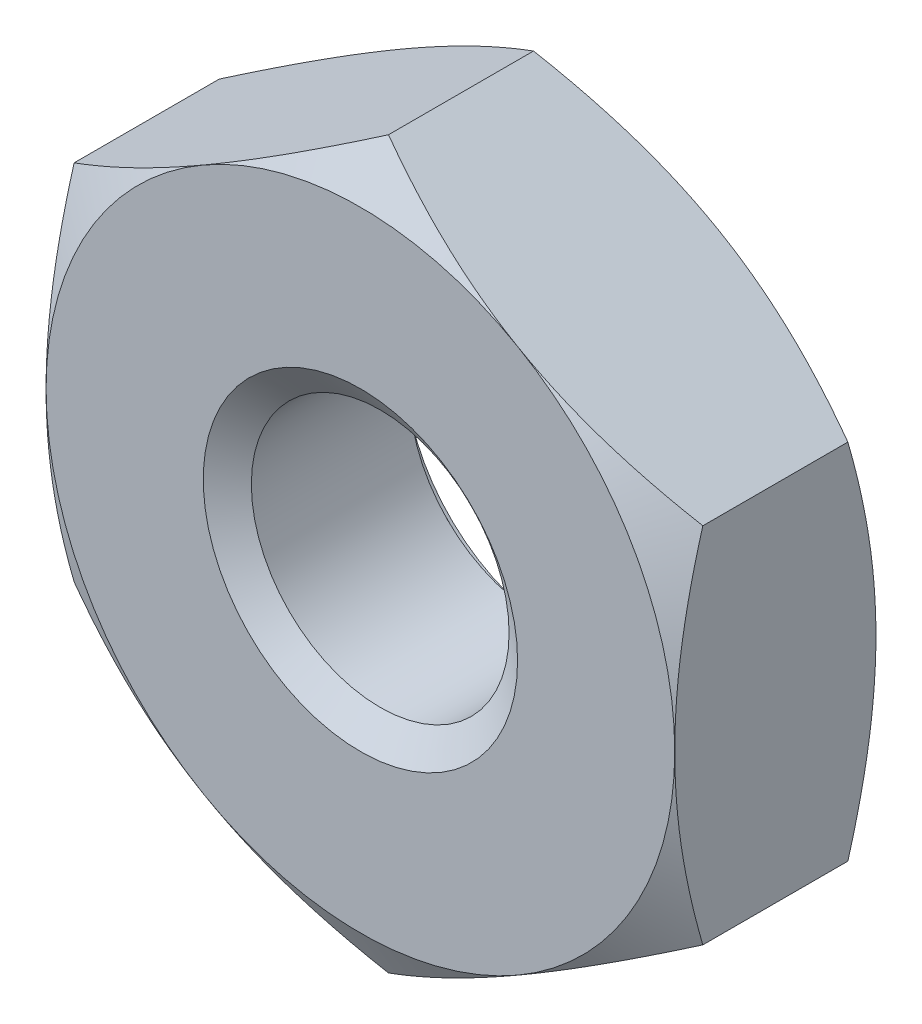
ISO-10303-21;
HEADER;
FILE_DESCRIPTION(('STEP AP214'),'2;1');
FILE_NAME('part.step','',(''),(''),'','','');
FILE_SCHEMA(('AUTOMOTIVE_DESIGN { 1 0 10303 214 1 1 1 1 }'));
ENDSEC;
DATA;
#1=APPLICATION_CONTEXT('core data for automotive mechanical design processes');
#2=APPLICATION_PROTOCOL_DEFINITION('international standard','automotive_design',2000,#1);
#3=PRODUCT_CONTEXT('',#1,'mechanical');
#4=PRODUCT('Part','Part','',(#3));
#5=PRODUCT_RELATED_PRODUCT_CATEGORY('part','',(#4));
#6=PRODUCT_DEFINITION_FORMATION('','',#4);
#7=PRODUCT_DEFINITION_CONTEXT('part definition',#1,'design');
#8=PRODUCT_DEFINITION('design','',#6,#7);
#9=PRODUCT_DEFINITION_SHAPE('','',#8);
#10=(LENGTH_UNIT() NAMED_UNIT(*) SI_UNIT(.MILLI.,.METRE.));
#11=(NAMED_UNIT(*) PLANE_ANGLE_UNIT() SI_UNIT($,.RADIAN.));
#12=(NAMED_UNIT(*) SI_UNIT($,.STERADIAN.) SOLID_ANGLE_UNIT());
#13=UNCERTAINTY_MEASURE_WITH_UNIT(LENGTH_MEASURE(1.E-05),#10,'distance_accuracy_value','');
#14=(GEOMETRIC_REPRESENTATION_CONTEXT(3) GLOBAL_UNCERTAINTY_ASSIGNED_CONTEXT((#13)) GLOBAL_UNIT_ASSIGNED_CONTEXT((#10,
#11,#12)) REPRESENTATION_CONTEXT('',''));
#15=CARTESIAN_POINT('',(0.,0.,0.));
#16=DIRECTION('',(0.,0.,1.));
#17=DIRECTION('',(1.,0.,0.));
#18=AXIS2_PLACEMENT_3D('',#15,#16,#17);
#19=CARTESIAN_POINT('',(0.,0.,-1.6));
#20=DIRECTION('',(0.,0.,1.));
#21=DIRECTION('',(1.,0.,0.));
#22=AXIS2_PLACEMENT_3D('',#19,#20,#21);
#23=CYLINDRICAL_SURFACE('',#22,1.025);
#24=CARTESIAN_POINT('',(0.,0.,-0.157546696097185));
#25=DIRECTION('',(0.,0.,1.));
#26=DIRECTION('',(1.,0.,0.));
#27=AXIS2_PLACEMENT_3D('',#24,#25,#26);
#28=CIRCLE('',#27,1.025);
#29=CARTESIAN_POINT('',(1.025,0.,-0.157546696097185));
#30=VERTEX_POINT('',#29);
#31=EDGE_CURVE('E175',#30,#30,#28,.F.);
#32=ORIENTED_EDGE('',*,*,#31,.F.);
#33=EDGE_LOOP('',(#32));
#34=FACE_BOUND('',#33,.T.);
#35=CARTESIAN_POINT('',(0.,0.,-1.41705330390281));
#36=DIRECTION('',(0.,0.,-1.));
#37=DIRECTION('',(-1.,0.,0.));
#38=AXIS2_PLACEMENT_3D('',#35,#36,#37);
#39=CIRCLE('',#38,1.025);
#40=CARTESIAN_POINT('',(-1.025,0.,-1.41705330390281));
#41=VERTEX_POINT('',#40);
#42=EDGE_CURVE('E40',#41,#41,#39,.F.);
#43=ORIENTED_EDGE('',*,*,#42,.F.);
#44=EDGE_LOOP('',(#43));
#45=FACE_BOUND('',#44,.T.);
#46=ADVANCED_FACE('F35',(#34,#45),#23,.F.);
#47=CARTESIAN_POINT('',(0.,2.88675134594813,-1.6));
#48=DIRECTION('',(0.,0.,-1.));
#49=DIRECTION('',(-1.,0.,0.));
#50=AXIS2_PLACEMENT_3D('',#47,#48,#49);
#51=PLANE('',#50);
#52=CARTESIAN_POINT('',(0.,0.,-1.6));
#53=DIRECTION('',(0.,0.,-1.));
#54=DIRECTION('',(-1.,0.,0.));
#55=AXIS2_PLACEMENT_3D('',#52,#53,#54);
#56=CIRCLE('',#55,2.5);
#57=CARTESIAN_POINT('',(-2.5,0.,-1.6));
#58=VERTEX_POINT('',#57);
#59=CARTESIAN_POINT('',(-1.25,-2.1650635094611,-1.6));
#60=VERTEX_POINT('',#59);
#61=EDGE_CURVE('E171',#58,#60,#56,.F.);
#62=ORIENTED_EDGE('',*,*,#61,.F.);
#63=CARTESIAN_POINT('',(-1.25,2.16506350946109,-1.6));
#64=VERTEX_POINT('',#63);
#65=EDGE_CURVE('E153',#64,#58,#56,.F.);
#66=ORIENTED_EDGE('',*,*,#65,.F.);
#67=CARTESIAN_POINT('',(1.25,2.16506350946109,-1.6));
#68=VERTEX_POINT('',#67);
#69=EDGE_CURVE('E170',#68,#64,#56,.F.);
#70=ORIENTED_EDGE('',*,*,#69,.F.);
#71=CARTESIAN_POINT('',(0.,0.,-1.6));
#72=DIRECTION('',(0.,0.,1.));
#73=DIRECTION('',(1.,0.,0.));
#74=AXIS2_PLACEMENT_3D('',#71,#72,#73);
#75=CIRCLE('',#74,2.5);
#76=CARTESIAN_POINT('',(2.5,0.,-1.6));
#77=VERTEX_POINT('',#76);
#78=EDGE_CURVE('E245',#77,#68,#75,.T.);
#79=ORIENTED_EDGE('',*,*,#78,.F.);
#80=CARTESIAN_POINT('',(1.25,-2.1650635094611,-1.6));
#81=VERTEX_POINT('',#80);
#82=EDGE_CURVE('E361',#81,#77,#56,.F.);
#83=ORIENTED_EDGE('',*,*,#82,.F.);
#84=EDGE_CURVE('E365',#60,#81,#56,.F.);
#85=ORIENTED_EDGE('',*,*,#84,.F.);
#86=EDGE_LOOP('',(#62,#66,#70,#79,#83,#85));
#87=FACE_BOUND('',#86,.T.);
#88=CARTESIAN_POINT('',(0.,0.,-1.6));
#89=DIRECTION('',(0.,0.,-1.));
#90=DIRECTION('',(-1.,0.,0.));
#91=AXIS2_PLACEMENT_3D('',#88,#89,#90);
#92=CIRCLE('',#91,1.25);
#93=CARTESIAN_POINT('',(-1.25,0.,-1.6));
#94=VERTEX_POINT('',#93);
#95=EDGE_CURVE('E178',#94,#94,#92,.F.);
#96=ORIENTED_EDGE('',*,*,#95,.T.);
#97=EDGE_LOOP('',(#96));
#98=FACE_BOUND('',#97,.T.);
#99=ADVANCED_FACE('F298',(#87,#98),#51,.T.);
#100=CARTESIAN_POINT('',(0.,2.88675134594813,0.));
#101=DIRECTION('',(0.,0.,-1.));
#102=DIRECTION('',(-1.,0.,0.));
#103=AXIS2_PLACEMENT_3D('',#100,#101,#102);
#104=PLANE('',#103);
#105=CARTESIAN_POINT('',(0.,0.,0.));
#106=DIRECTION('',(0.,0.,-1.));
#107=DIRECTION('',(-1.,0.,0.));
#108=AXIS2_PLACEMENT_3D('',#105,#106,#107);
#109=CIRCLE('',#108,2.5);
#110=CARTESIAN_POINT('',(-2.5,0.,0.));
#111=VERTEX_POINT('',#110);
#112=CARTESIAN_POINT('',(-1.25,2.16506350946109,0.));
#113=VERTEX_POINT('',#112);
#114=EDGE_CURVE('E11',#111,#113,#109,.T.);
#115=ORIENTED_EDGE('',*,*,#114,.F.);
#116=CARTESIAN_POINT('',(-1.25,-2.1650635094611,0.));
#117=VERTEX_POINT('',#116);
#118=EDGE_CURVE('E47',#117,#111,#109,.T.);
#119=ORIENTED_EDGE('',*,*,#118,.F.);
#120=CARTESIAN_POINT('',(1.25,-2.1650635094611,0.));
#121=VERTEX_POINT('',#120);
#122=EDGE_CURVE('E174',#121,#117,#109,.T.);
#123=ORIENTED_EDGE('',*,*,#122,.F.);
#124=CARTESIAN_POINT('',(2.5,0.,0.));
#125=VERTEX_POINT('',#124);
#126=EDGE_CURVE('E352',#125,#121,#109,.T.);
#127=ORIENTED_EDGE('',*,*,#126,.F.);
#128=CARTESIAN_POINT('',(0.,0.,0.));
#129=DIRECTION('',(0.,0.,1.));
#130=DIRECTION('',(1.,0.,0.));
#131=AXIS2_PLACEMENT_3D('',#128,#129,#130);
#132=CIRCLE('',#131,2.5);
#133=CARTESIAN_POINT('',(1.25,2.16506350946109,0.));
#134=VERTEX_POINT('',#133);
#135=EDGE_CURVE('E129',#125,#134,#132,.T.);
#136=ORIENTED_EDGE('',*,*,#135,.T.);
#137=EDGE_CURVE('E45',#113,#134,#109,.T.);
#138=ORIENTED_EDGE('',*,*,#137,.F.);
#139=EDGE_LOOP('',(#115,#119,#123,#127,#136,#138));
#140=FACE_BOUND('',#139,.T.);
#141=CARTESIAN_POINT('',(0.,0.,0.));
#142=DIRECTION('',(0.,0.,1.));
#143=DIRECTION('',(1.,0.,0.));
#144=AXIS2_PLACEMENT_3D('',#141,#142,#143);
#145=CIRCLE('',#144,1.25);
#146=CARTESIAN_POINT('',(1.25,0.,0.));
#147=VERTEX_POINT('',#146);
#148=EDGE_CURVE('E177',#147,#147,#145,.T.);
#149=ORIENTED_EDGE('',*,*,#148,.F.);
#150=EDGE_LOOP('',(#149));
#151=FACE_BOUND('',#150,.T.);
#152=ADVANCED_FACE('F250',(#140,#151),#104,.F.);
#153=CARTESIAN_POINT('',(0.,2.88675134594813,-1.6));
#154=DIRECTION('',(-0.500000000000001,0.866025403784438,0.));
#155=DIRECTION('',(-0.866025403784438,-0.500000000000001,0.));
#156=AXIS2_PLACEMENT_3D('',#153,#154,#155);
#157=PLANE('',#156);
#158=DIRECTION('',(0.,0.,1.));
#159=VECTOR('',#158,1.);
#160=CARTESIAN_POINT('',(-2.5,1.44337567297406,-1.6));
#161=LINE('',#160,#159);
#162=CARTESIAN_POINT('',(-2.5,1.44337567297407,-1.3767090063074));
#163=VERTEX_POINT('',#162);
#164=CARTESIAN_POINT('',(-2.5,1.44337567297406,-0.223290993692603));
#165=VERTEX_POINT('',#164);
#166=EDGE_CURVE('E165',#163,#165,#161,.T.);
#167=ORIENTED_EDGE('',*,*,#166,.T.);
#168=CARTESIAN_POINT('',(-2.5002,1.44326020292022,-0.22335766435911));
#169=CARTESIAN_POINT('',(-2.39033676526513,1.50668977106845,-0.186721620107627));
#170=CARTESIAN_POINT('',(-2.27952520010347,1.57066685804385,-0.153402218965057));
#171=CARTESIAN_POINT('',(-2.05598316653395,1.69972891130041,-0.0952422855578582));
#172=CARTESIAN_POINT('',(-1.94324872547161,1.7648161711947,-0.0704223291477386));
#173=CARTESIAN_POINT('',(-1.71917700612473,1.8941840386774,-0.031785651441052));
#174=CARTESIAN_POINT('',(-1.60787420823262,1.95844473900197,-0.0177117961856388));
#175=CARTESIAN_POINT('',(-1.38474477253167,2.08726857876804,-0.000909152352750181));
#176=CARTESIAN_POINT('',(-1.27291894598577,2.15183124982667,0.00183354879637314));
#177=CARTESIAN_POINT('',(-1.06395802444848,2.27247489412634,-0.00386576000805407));
#178=CARTESIAN_POINT('',(-0.966791682442269,2.32857390783979,-0.0109083943818623));
#179=CARTESIAN_POINT('',(-0.773092050288998,2.44040644260542,-0.0332314191249434));
#180=CARTESIAN_POINT('',(-0.676559430340268,2.4961395767184,-0.0485194384402683));
#181=CARTESIAN_POINT('',(-0.482460278259524,2.60820277442169,-0.0867390938444221));
#182=CARTESIAN_POINT('',(-0.384918318217859,2.66451865130903,-0.109832776125519));
#183=CARTESIAN_POINT('',(-0.191289391923915,2.77631036402774,-0.162246656577916));
#184=CARTESIAN_POINT('',(-0.0951999441138235,2.83178763258718,-0.191554535624552));
#185=CARTESIAN_POINT('',(0.000200000000000428,2.88686681600197,-0.223357664359112));
#186=B_SPLINE_CURVE_WITH_KNOTS('',3,(#168,#169,#170,#171,#172,#173,#174,#175,#176,#177,#178,
#179,#180,#181,#182,#183,#184,#185),.UNSPECIFIED.,.F.,.F.,(4,2,2,2,2,2,2,2,4),(0.,
0.396285827362227,0.793524330152052,1.18093086852114,1.56786160134475,1.90479741793733,
2.24204551660463,2.58677531536756,2.93082800105257),.UNSPECIFIED.);
#187=EDGE_CURVE('E134',#165,#113,#186,.T.);
#188=ORIENTED_EDGE('',*,*,#187,.T.);
#189=CARTESIAN_POINT('',(0.,2.88675134594813,-0.223290993692605));
#190=VERTEX_POINT('',#189);
#191=EDGE_CURVE('E54',#113,#190,#186,.T.);
#192=ORIENTED_EDGE('',*,*,#191,.T.);
#193=DIRECTION('',(0.,0.,1.));
#194=VECTOR('',#193,1.);
#195=CARTESIAN_POINT('',(0.,2.88675134594813,-1.6));
#196=LINE('',#195,#194);
#197=CARTESIAN_POINT('',(0.,2.88675134594813,-1.3767090063074));
#198=VERTEX_POINT('',#197);
#199=EDGE_CURVE('E150',#198,#190,#196,.T.);
#200=ORIENTED_EDGE('',*,*,#199,.F.);
#201=CARTESIAN_POINT('',(-2.5002,1.44326020292022,-1.37664233564089));
#202=CARTESIAN_POINT('',(-2.39033676526513,1.50668977106845,-1.41327837989237));
#203=CARTESIAN_POINT('',(-2.27952520010347,1.57066685804385,-1.44659778103494));
#204=CARTESIAN_POINT('',(-2.05598316653395,1.69972891130041,-1.50475771444214));
#205=CARTESIAN_POINT('',(-1.94324872547161,1.7648161711947,-1.52957767085226));
#206=CARTESIAN_POINT('',(-1.71917700612473,1.8941840386774,-1.56821434855895));
#207=CARTESIAN_POINT('',(-1.60787420823262,1.95844473900197,-1.58228820381436));
#208=CARTESIAN_POINT('',(-1.38474477253167,2.08726857876804,-1.59909084764725));
#209=CARTESIAN_POINT('',(-1.27291894598577,2.15183124982667,-1.60183354879637));
#210=CARTESIAN_POINT('',(-1.06395802444848,2.27247489412634,-1.59613423999195));
#211=CARTESIAN_POINT('',(-0.966791682442269,2.32857390783979,-1.58909160561814));
#212=CARTESIAN_POINT('',(-0.773092050288998,2.44040644260542,-1.56676858087506));
#213=CARTESIAN_POINT('',(-0.676559430340268,2.4961395767184,-1.55148056155973));
#214=CARTESIAN_POINT('',(-0.482460278259524,2.60820277442169,-1.51326090615558));
#215=CARTESIAN_POINT('',(-0.384918318217859,2.66451865130903,-1.49016722387448));
#216=CARTESIAN_POINT('',(-0.191289391923915,2.77631036402774,-1.43775334342208));
#217=CARTESIAN_POINT('',(-0.0951999441138235,2.83178763258718,-1.40844546437545));
#218=CARTESIAN_POINT('',(0.000200000000000423,2.88686681600197,-1.37664233564089));
#219=B_SPLINE_CURVE_WITH_KNOTS('',3,(#201,#202,#203,#204,#205,#206,#207,#208,#209,#210,#211,
#212,#213,#214,#215,#216,#217,#218),.UNSPECIFIED.,.F.,.F.,(4,2,2,2,2,2,2,2,4),(0.,
0.396285827362227,0.793524330152052,1.18093086852114,1.56786160134475,1.90479741793733,
2.24204551660463,2.58677531536756,2.93082800105257),.UNSPECIFIED.);
#220=EDGE_CURVE('E168',#64,#198,#219,.T.);
#221=ORIENTED_EDGE('',*,*,#220,.F.);
#222=EDGE_CURVE('E260',#163,#64,#219,.T.);
#223=ORIENTED_EDGE('',*,*,#222,.F.);
#224=EDGE_LOOP('',(#167,#188,#192,#200,#221,#223));
#225=FACE_BOUND('',#224,.T.);
#226=ADVANCED_FACE('F37',(#225),#157,.T.);
#227=CARTESIAN_POINT('',(2.5,1.44337567297406,-1.6));
#228=DIRECTION('',(0.500000000000001,0.866025403784438,0.));
#229=DIRECTION('',(-0.866025403784438,0.500000000000001,0.));
#230=AXIS2_PLACEMENT_3D('',#227,#228,#229);
#231=PLANE('',#230);
#232=ORIENTED_EDGE('',*,*,#199,.T.);
#233=CARTESIAN_POINT('',(-0.000199999999999785,2.88686681600197,-0.223357664359112));
#234=CARTESIAN_POINT('',(0.109663234734872,2.82343724785375,-0.186721620107629));
#235=CARTESIAN_POINT('',(0.220474799896526,2.75946016087834,-0.153402218965059));
#236=CARTESIAN_POINT('',(0.44401683346605,2.63039810762178,-0.0952422855578596));
#237=CARTESIAN_POINT('',(0.556751274528389,2.5653108477275,-0.0704223291477398));
#238=CARTESIAN_POINT('',(0.78082299387527,2.43594298024479,-0.0317856514410529));
#239=CARTESIAN_POINT('',(0.892125791767378,2.37168227992023,-0.0177117961856395));
#240=CARTESIAN_POINT('',(1.11525522746834,2.24285844015415,-0.000909152352750354));
#241=CARTESIAN_POINT('',(1.22708105401423,2.17829576909552,0.00183354879637332));
#242=CARTESIAN_POINT('',(1.43604197555152,2.05765212479586,-0.00386576000805363));
#243=CARTESIAN_POINT('',(1.53320831755773,2.0015531110824,-0.0109083943818618));
#244=CARTESIAN_POINT('',(1.726907949711,1.88972057631678,-0.0332314191249427));
#245=CARTESIAN_POINT('',(1.82344056965973,1.8339874422038,-0.0485194384402672));
#246=CARTESIAN_POINT('',(2.01753972174048,1.7219242445005,-0.0867390938444206));
#247=CARTESIAN_POINT('',(2.11508168178214,1.66560836761316,-0.109832776125517));
#248=CARTESIAN_POINT('',(2.30871060807609,1.55381665489445,-0.162246656577914));
#249=CARTESIAN_POINT('',(2.40480005588618,1.49833938633502,-0.19155453562455));
#250=CARTESIAN_POINT('',(2.5002,1.44326020292022,-0.223357664359109));
#251=B_SPLINE_CURVE_WITH_KNOTS('',3,(#233,#234,#235,#236,#237,#238,#239,#240,#241,#242,#243,
#244,#245,#246,#247,#248,#249,#250),.UNSPECIFIED.,.F.,.F.,(4,2,2,2,2,2,2,2,4),(0.,
0.396285827362227,0.793524330152053,1.18093086852114,1.56786160134476,1.90479741793733,
2.24204551660463,2.58677531536756,2.93082800105257),.UNSPECIFIED.);
#252=EDGE_CURVE('E144',#190,#134,#251,.T.);
#253=ORIENTED_EDGE('',*,*,#252,.T.);
#254=CARTESIAN_POINT('',(2.5,1.44337567297407,-0.223290993692605));
#255=VERTEX_POINT('',#254);
#256=EDGE_CURVE('E61',#134,#255,#251,.T.);
#257=ORIENTED_EDGE('',*,*,#256,.T.);
#258=DIRECTION('',(0.,0.,1.));
#259=VECTOR('',#258,1.);
#260=CARTESIAN_POINT('',(2.5,1.44337567297406,-1.6));
#261=LINE('',#260,#259);
#262=CARTESIAN_POINT('',(2.5,1.44337567297407,-1.3767090063074));
#263=VERTEX_POINT('',#262);
#264=EDGE_CURVE('E143',#263,#255,#261,.T.);
#265=ORIENTED_EDGE('',*,*,#264,.F.);
#266=CARTESIAN_POINT('',(-0.000199999999999792,2.88686681600197,-1.37664233564089));
#267=CARTESIAN_POINT('',(0.109663234734872,2.82343724785375,-1.41327837989237));
#268=CARTESIAN_POINT('',(0.220474799896526,2.75946016087834,-1.44659778103494));
#269=CARTESIAN_POINT('',(0.44401683346605,2.63039810762178,-1.50475771444214));
#270=CARTESIAN_POINT('',(0.556751274528389,2.5653108477275,-1.52957767085226));
#271=CARTESIAN_POINT('',(0.78082299387527,2.43594298024479,-1.56821434855895));
#272=CARTESIAN_POINT('',(0.892125791767378,2.37168227992023,-1.58228820381436));
#273=CARTESIAN_POINT('',(1.11525522746834,2.24285844015415,-1.59909084764725));
#274=CARTESIAN_POINT('',(1.22708105401423,2.17829576909552,-1.60183354879637));
#275=CARTESIAN_POINT('',(1.43604197555152,2.05765212479586,-1.59613423999195));
#276=CARTESIAN_POINT('',(1.53320831755773,2.0015531110824,-1.58909160561814));
#277=CARTESIAN_POINT('',(1.726907949711,1.88972057631678,-1.56676858087506));
#278=CARTESIAN_POINT('',(1.82344056965973,1.8339874422038,-1.55148056155973));
#279=CARTESIAN_POINT('',(2.01753972174048,1.7219242445005,-1.51326090615558));
#280=CARTESIAN_POINT('',(2.11508168178214,1.66560836761316,-1.49016722387448));
#281=CARTESIAN_POINT('',(2.30871060807609,1.55381665489445,-1.43775334342209));
#282=CARTESIAN_POINT('',(2.40480005588618,1.49833938633502,-1.40844546437545));
#283=CARTESIAN_POINT('',(2.5002,1.44326020292022,-1.37664233564089));
#284=B_SPLINE_CURVE_WITH_KNOTS('',3,(#266,#267,#268,#269,#270,#271,#272,#273,#274,#275,#276,
#277,#278,#279,#280,#281,#282,#283),.UNSPECIFIED.,.F.,.F.,(4,2,2,2,2,2,2,2,4),(0.,
0.396285827362227,0.793524330152052,1.18093086852114,1.56786160134476,1.90479741793733,
2.24204551660463,2.58677531536756,2.93082800105257),.UNSPECIFIED.);
#285=EDGE_CURVE('E254',#68,#263,#284,.T.);
#286=ORIENTED_EDGE('',*,*,#285,.F.);
#287=EDGE_CURVE('E259',#198,#68,#284,.T.);
#288=ORIENTED_EDGE('',*,*,#287,.F.);
#289=EDGE_LOOP('',(#232,#253,#257,#265,#286,#288));
#290=FACE_BOUND('',#289,.T.);
#291=ADVANCED_FACE('F141',(#290),#231,.T.);
#292=CARTESIAN_POINT('',(2.5,1.44337567297406,-1.6));
#293=DIRECTION('',(-1.,0.,0.));
#294=DIRECTION('',(0.,0.,1.));
#295=AXIS2_PLACEMENT_3D('',#292,#293,#294);
#296=PLANE('',#295);
#297=CARTESIAN_POINT('',(2.5,-3.82804499372433,-1.1963167632754));
#298=CARTESIAN_POINT('',(2.5,-3.71828085649173,-1.14327266922932));
#299=CARTESIAN_POINT('',(2.5,-3.60825720059554,-1.09075587737963));
#300=CARTESIAN_POINT('',(2.5,-3.38755052986222,-0.987078216748231));
#301=CARTESIAN_POINT('',(2.5,-3.27686740487455,-0.935917582729523));
#302=CARTESIAN_POINT('',(2.5,-3.05410357303959,-0.834984039411601));
#303=CARTESIAN_POINT('',(2.5,-2.94201849305851,-0.785220746914401));
#304=CARTESIAN_POINT('',(2.5,-2.71692709217039,-0.687831615887688));
#305=CARTESIAN_POINT('',(2.5,-2.60392081964711,-0.640205665942515));
#306=CARTESIAN_POINT('',(2.5,-2.37540441715611,-0.547094156496478));
#307=CARTESIAN_POINT('',(2.5,-2.25988058014231,-0.501642052634905));
#308=CARTESIAN_POINT('',(2.5,-2.02747029246855,-0.414297644349639));
#309=CARTESIAN_POINT('',(2.5,-1.91058369184876,-0.372405735979067));
#310=CARTESIAN_POINT('',(2.5,-1.67550198908607,-0.293307342769302));
#311=CARTESIAN_POINT('',(2.5,-1.5573102732053,-0.256090896739899));
#312=CARTESIAN_POINT('',(2.5,-1.31924659147407,-0.187552097840317));
#313=CARTESIAN_POINT('',(2.5,-1.19937516991093,-0.156227881047971));
#314=CARTESIAN_POINT('',(2.5,-0.957870204363751,-0.100994246846277));
#315=CARTESIAN_POINT('',(2.5,-0.836236200197811,-0.0770868037228384));
#316=CARTESIAN_POINT('',(2.5,-0.591501703670347,-0.0382963974514653));
#317=CARTESIAN_POINT('',(2.5,-0.46840121001236,-0.0234134422823124));
#318=CARTESIAN_POINT('',(2.5,-0.222157493517465,-0.003988633218398));
#319=CARTESIAN_POINT('',(2.5,-0.099019569433758,0.000618687975650629));
#320=CARTESIAN_POINT('',(2.5,0.147170053504667,-0.000752541484247585));
#321=CARTESIAN_POINT('',(2.5,0.270221766445127,-0.00672834425959475));
#322=CARTESIAN_POINT('',(2.5,0.480350397015947,-0.0255492091334947));
#323=CARTESIAN_POINT('',(2.5,0.567659136488636,-0.035943310027444));
#324=CARTESIAN_POINT('',(2.5,0.741602181646856,-0.0613833814666827));
#325=CARTESIAN_POINT('',(2.5,0.828236378756331,-0.0764300856615293));
#326=CARTESIAN_POINT('',(2.5,1.08705653408106,-0.127759419343895));
#327=CARTESIAN_POINT('',(2.5,1.25802931580451,-0.170218054015721));
#328=CARTESIAN_POINT('',(2.5,1.51386408134077,-0.243447724573253));
#329=CARTESIAN_POINT('',(2.5,1.60005960225961,-0.269821213632273));
#330=CARTESIAN_POINT('',(2.5,1.77155099438377,-0.325177862642352));
#331=CARTESIAN_POINT('',(2.5,1.85684744139723,-0.354159222616821));
#332=CARTESIAN_POINT('',(2.5,2.02618400322713,-0.41412856198768));
#333=CARTESIAN_POINT('',(2.5,2.11022848716773,-0.445104328595938));
#334=CARTESIAN_POINT('',(2.5,2.27766538220571,-0.50887397111919));
#335=CARTESIAN_POINT('',(2.5,2.36105751399617,-0.541668581852106));
#336=CARTESIAN_POINT('',(2.5,2.44414811866677,-0.575193129088621));
#337=B_SPLINE_CURVE_WITH_KNOTS('',3,(#297,#298,#299,#300,#301,#302,#303,#304,#305,#306,#307,
#308,#309,#310,#311,#312,#313,#314,#315,#316,#317,#318,#319,#320,#321,#322,#323,#324,#325,#326,
#327,#328,#329,#330,#331,#332,#333,#334,#335,#336),.UNSPECIFIED.,.F.,.F.,(4,2,2,2,2,2,2,2,2,2,2,
2,2,2,2,2,2,2,2,4),(0.,0.36573237033267,0.731527644124543,1.09941621653744,1.46728558928017,
1.83967125623427,2.21209829506681,2.58371790436,2.9552197586967,3.32682041917403,
3.69842140819258,4.06764803658773,4.43677881037429,4.70042588015951,4.96411454456775,
5.49188432099894,5.76228301186056,6.03249648197686,6.30118900914356,6.56999089095293),.UNSPECIFIED.);
#338=CARTESIAN_POINT('',(2.5,-1.44337567297407,-0.223290993692605));
#339=VERTEX_POINT('',#338);
#340=EDGE_CURVE('E136',#339,#125,#337,.T.);
#341=ORIENTED_EDGE('',*,*,#340,.F.);
#342=DIRECTION('',(0.,0.,1.));
#343=VECTOR('',#342,1.);
#344=CARTESIAN_POINT('',(2.5,-1.44337567297407,-1.6));
#345=LINE('',#344,#343);
#346=CARTESIAN_POINT('',(2.5,-1.44337567297407,-1.3767090063074));
#347=VERTEX_POINT('',#346);
#348=EDGE_CURVE('E151',#347,#339,#345,.T.);
#349=ORIENTED_EDGE('',*,*,#348,.F.);
#350=CARTESIAN_POINT('',(2.5,-3.82804499372433,-0.403683236724595));
#351=CARTESIAN_POINT('',(2.5,-3.71828085649173,-0.456727330770684));
#352=CARTESIAN_POINT('',(2.5,-3.60825720059554,-0.509244122620372));
#353=CARTESIAN_POINT('',(2.5,-3.38755052986222,-0.612921783251769));
#354=CARTESIAN_POINT('',(2.5,-3.27686740487455,-0.664082417270477));
#355=CARTESIAN_POINT('',(2.5,-3.05410357303959,-0.765015960588399));
#356=CARTESIAN_POINT('',(2.5,-2.94201849305851,-0.814779253085598));
#357=CARTESIAN_POINT('',(2.5,-2.7169270921704,-0.912168384112311));
#358=CARTESIAN_POINT('',(2.5,-2.60392081964711,-0.959794334057485));
#359=CARTESIAN_POINT('',(2.5,-2.37540441715611,-1.05290584350352));
#360=CARTESIAN_POINT('',(2.5,-2.25988058014231,-1.09835794736509));
#361=CARTESIAN_POINT('',(2.5,-2.02747029246855,-1.18570235565036));
#362=CARTESIAN_POINT('',(2.5,-1.91058369184876,-1.22759426402093));
#363=CARTESIAN_POINT('',(2.5,-1.67550198908607,-1.3066926572307));
#364=CARTESIAN_POINT('',(2.5,-1.5573102732053,-1.3439091032601));
#365=CARTESIAN_POINT('',(2.5,-1.31924659147407,-1.41244790215968));
#366=CARTESIAN_POINT('',(2.5,-1.19937516991093,-1.44377211895203));
#367=CARTESIAN_POINT('',(2.5,-0.957870204363751,-1.49900575315372));
#368=CARTESIAN_POINT('',(2.5,-0.836236200197811,-1.52291319627716));
#369=CARTESIAN_POINT('',(2.5,-0.591501703670347,-1.56170360254853));
#370=CARTESIAN_POINT('',(2.5,-0.46840121001236,-1.57658655771769));
#371=CARTESIAN_POINT('',(2.5,-0.222157493517465,-1.5960113667816));
#372=CARTESIAN_POINT('',(2.5,-0.099019569433758,-1.60061868797565));
#373=CARTESIAN_POINT('',(2.5,0.147170053504667,-1.59924745851575));
#374=CARTESIAN_POINT('',(2.5,0.270221766445127,-1.59327165574041));
#375=CARTESIAN_POINT('',(2.5,0.480350397015947,-1.57445079086651));
#376=CARTESIAN_POINT('',(2.5,0.567659136488636,-1.56405668997256));
#377=CARTESIAN_POINT('',(2.5,0.741602181646856,-1.53861661853332));
#378=CARTESIAN_POINT('',(2.5,0.828236378756331,-1.52356991433847));
#379=CARTESIAN_POINT('',(2.5,1.08705653408106,-1.47224058065611));
#380=CARTESIAN_POINT('',(2.5,1.25802931580451,-1.42978194598428));
#381=CARTESIAN_POINT('',(2.5,1.51386408134077,-1.35655227542675));
#382=CARTESIAN_POINT('',(2.5,1.60005960225961,-1.33017878636773));
#383=CARTESIAN_POINT('',(2.5,1.77155099438377,-1.27482213735765));
#384=CARTESIAN_POINT('',(2.5,1.85684744139723,-1.24584077738318));
#385=CARTESIAN_POINT('',(2.5,2.02618400322712,-1.18587143801232));
#386=CARTESIAN_POINT('',(2.5,2.11022848716773,-1.15489567140406));
#387=CARTESIAN_POINT('',(2.5,2.27766538220571,-1.09112602888081));
#388=CARTESIAN_POINT('',(2.5,2.36105751399616,-1.05833141814789));
#389=CARTESIAN_POINT('',(2.5,2.44414811866677,-1.02480687091138));
#390=B_SPLINE_CURVE_WITH_KNOTS('',3,(#350,#351,#352,#353,#354,#355,#356,#357,#358,#359,#360,
#361,#362,#363,#364,#365,#366,#367,#368,#369,#370,#371,#372,#373,#374,#375,#376,#377,#378,#379,
#380,#381,#382,#383,#384,#385,#386,#387,#388,#389),.UNSPECIFIED.,.F.,.F.,(4,2,2,2,2,2,2,2,2,2,2,
2,2,2,2,2,2,2,2,4),(0.,0.36573237033267,0.731527644124543,1.09941621653744,1.46728558928017,
1.83967125623427,2.21209829506681,2.58371790436,2.9552197586967,3.32682041917403,
3.69842140819258,4.06764803658773,4.43677881037429,4.70042588015951,4.96411454456775,
5.49188432099893,5.76228301186056,6.03249648197686,6.30118900914356,6.56999089095293),.UNSPECIFIED.);
#391=EDGE_CURVE('E266',#347,#77,#390,.T.);
#392=ORIENTED_EDGE('',*,*,#391,.T.);
#393=EDGE_CURVE('E149',#77,#263,#390,.T.);
#394=ORIENTED_EDGE('',*,*,#393,.T.);
#395=ORIENTED_EDGE('',*,*,#264,.T.);
#396=EDGE_CURVE('E126',#125,#255,#337,.T.);
#397=ORIENTED_EDGE('',*,*,#396,.F.);
#398=EDGE_LOOP('',(#341,#349,#392,#394,#395,#397));
#399=FACE_BOUND('',#398,.T.);
#400=ADVANCED_FACE('F147',(#399),#296,.F.);
#401=CARTESIAN_POINT('',(0.,-2.88675134594814,-1.6));
#402=DIRECTION('',(0.500000000000001,-0.866025403784438,0.));
#403=DIRECTION('',(0.866025403784438,0.500000000000001,0.));
#404=AXIS2_PLACEMENT_3D('',#401,#402,#403);
#405=PLANE('',#404);
#406=ORIENTED_EDGE('',*,*,#348,.T.);
#407=CARTESIAN_POINT('',(2.5002,-1.44326020292023,-0.223357664359112));
#408=CARTESIAN_POINT('',(2.39033676526513,-1.50668977106845,-0.186721620107629));
#409=CARTESIAN_POINT('',(2.27952520010347,-1.57066685804386,-0.153402218965059));
#410=CARTESIAN_POINT('',(2.05598316653395,-1.69972891130042,-0.0952422855578604));
#411=CARTESIAN_POINT('',(1.94324872547161,-1.7648161711947,-0.0704223291477407));
#412=CARTESIAN_POINT('',(1.71917700612473,-1.89418403867741,-0.0317856514410544));
#413=CARTESIAN_POINT('',(1.60787420823262,-1.95844473900197,-0.0177117961856415));
#414=CARTESIAN_POINT('',(1.38474477253167,-2.08726857876805,-0.000909152352753037));
#415=CARTESIAN_POINT('',(1.27291894598577,-2.15183124982667,0.00183354879637051));
#416=CARTESIAN_POINT('',(1.06395802444848,-2.27247489412634,-0.00386576000805692));
#417=CARTESIAN_POINT('',(0.966791682442268,-2.3285739078398,-0.0109083943818655));
#418=CARTESIAN_POINT('',(0.773092050288997,-2.44040644260542,-0.0332314191249468));
#419=CARTESIAN_POINT('',(0.676559430340267,-2.4961395767184,-0.0485194384402716));
#420=CARTESIAN_POINT('',(0.482460278259523,-2.6082027744217,-0.0867390938444252));
#421=CARTESIAN_POINT('',(0.384918318217859,-2.66451865130904,-0.109832776125522));
#422=CARTESIAN_POINT('',(0.191289391923915,-2.77631036402774,-0.162246656577919));
#423=CARTESIAN_POINT('',(0.0951999441138237,-2.83178763258718,-0.191554535624555));
#424=CARTESIAN_POINT('',(-0.000200000000000116,-2.88686681600197,-0.223357664359115));
#425=B_SPLINE_CURVE_WITH_KNOTS('',3,(#407,#408,#409,#410,#411,#412,#413,#414,#415,#416,#417,
#418,#419,#420,#421,#422,#423,#424),.UNSPECIFIED.,.F.,.F.,(4,2,2,2,2,2,2,2,4),(0.,
0.396285827362227,0.793524330152052,1.18093086852114,1.56786160134476,1.90479741793733,
2.24204551660463,2.58677531536756,2.93082800105257),.UNSPECIFIED.);
#426=EDGE_CURVE('E347',#339,#121,#425,.T.);
#427=ORIENTED_EDGE('',*,*,#426,.T.);
#428=CARTESIAN_POINT('',(0.,-2.88675134594813,-0.223290993692605));
#429=VERTEX_POINT('',#428);
#430=EDGE_CURVE('E226',#121,#429,#425,.T.);
#431=ORIENTED_EDGE('',*,*,#430,.T.);
#432=DIRECTION('',(0.,0.,1.));
#433=VECTOR('',#432,1.);
#434=CARTESIAN_POINT('',(0.,-2.88675134594814,-1.6));
#435=LINE('',#434,#433);
#436=CARTESIAN_POINT('',(0.,-2.88675134594813,-1.3767090063074));
#437=VERTEX_POINT('',#436);
#438=EDGE_CURVE('E156',#437,#429,#435,.T.);
#439=ORIENTED_EDGE('',*,*,#438,.F.);
#440=CARTESIAN_POINT('',(2.5002,-1.44326020292023,-1.37664233564089));
#441=CARTESIAN_POINT('',(2.39033676526513,-1.50668977106845,-1.41327837989237));
#442=CARTESIAN_POINT('',(2.27952520010347,-1.57066685804386,-1.44659778103494));
#443=CARTESIAN_POINT('',(2.05598316653395,-1.69972891130042,-1.50475771444214));
#444=CARTESIAN_POINT('',(1.94324872547161,-1.7648161711947,-1.52957767085226));
#445=CARTESIAN_POINT('',(1.71917700612473,-1.89418403867741,-1.56821434855895));
#446=CARTESIAN_POINT('',(1.60787420823262,-1.95844473900197,-1.58228820381436));
#447=CARTESIAN_POINT('',(1.38474477253167,-2.08726857876805,-1.59909084764725));
#448=CARTESIAN_POINT('',(1.27291894598577,-2.15183124982667,-1.60183354879637));
#449=CARTESIAN_POINT('',(1.06395802444848,-2.27247489412634,-1.59613423999194));
#450=CARTESIAN_POINT('',(0.966791682442268,-2.3285739078398,-1.58909160561813));
#451=CARTESIAN_POINT('',(0.773092050288997,-2.44040644260542,-1.56676858087505));
#452=CARTESIAN_POINT('',(0.676559430340267,-2.4961395767184,-1.55148056155973));
#453=CARTESIAN_POINT('',(0.482460278259524,-2.6082027744217,-1.51326090615557));
#454=CARTESIAN_POINT('',(0.384918318217859,-2.66451865130904,-1.49016722387448));
#455=CARTESIAN_POINT('',(0.191289391923915,-2.77631036402774,-1.43775334342208));
#456=CARTESIAN_POINT('',(0.095199944113824,-2.83178763258718,-1.40844546437545));
#457=CARTESIAN_POINT('',(-0.0001999999999998,-2.88686681600197,-1.37664233564089));
#458=B_SPLINE_CURVE_WITH_KNOTS('',3,(#440,#441,#442,#443,#444,#445,#446,#447,#448,#449,#450,
#451,#452,#453,#454,#455,#456,#457),.UNSPECIFIED.,.F.,.F.,(4,2,2,2,2,2,2,2,4),(0.,
0.396285827362227,0.793524330152052,1.18093086852114,1.56786160134476,1.90479741793733,
2.24204551660463,2.58677531536756,2.93082800105257),.UNSPECIFIED.);
#459=EDGE_CURVE('E272',#81,#437,#458,.T.);
#460=ORIENTED_EDGE('',*,*,#459,.F.);
#461=EDGE_CURVE('E271',#347,#81,#458,.T.);
#462=ORIENTED_EDGE('',*,*,#461,.F.);
#463=EDGE_LOOP('',(#406,#427,#431,#439,#460,#462));
#464=FACE_BOUND('',#463,.T.);
#465=ADVANCED_FACE('F282',(#464),#405,.T.);
#466=CARTESIAN_POINT('',(-2.5,-1.44337567297407,-1.6));
#467=DIRECTION('',(-0.500000000000001,-0.866025403784438,0.));
#468=DIRECTION('',(0.866025403784438,-0.500000000000001,0.));
#469=AXIS2_PLACEMENT_3D('',#466,#467,#468);
#470=PLANE('',#469);
#471=ORIENTED_EDGE('',*,*,#438,.T.);
#472=CARTESIAN_POINT('',(0.0002,-2.88686681600197,-0.223357664359115));
#473=CARTESIAN_POINT('',(-0.109663234734872,-2.82343724785375,-0.186721620107632));
#474=CARTESIAN_POINT('',(-0.220474799896526,-2.75946016087835,-0.153402218965062));
#475=CARTESIAN_POINT('',(-0.444016833466051,-2.63039810762179,-0.0952422855578624));
#476=CARTESIAN_POINT('',(-0.55675127452839,-2.5653108477275,-0.0704223291477426));
#477=CARTESIAN_POINT('',(-0.780822993875271,-2.4359429802448,-0.0317856514410557));
#478=CARTESIAN_POINT('',(-0.892125791767379,-2.37168227992023,-0.0177117961856424));
#479=CARTESIAN_POINT('',(-1.11525522746834,-2.24285844015415,-0.000909152352753405));
#480=CARTESIAN_POINT('',(-1.22708105401423,-2.17829576909553,0.00183354879637023));
#481=CARTESIAN_POINT('',(-1.43604197555152,-2.05765212479586,-0.00386576000805667));
#482=CARTESIAN_POINT('',(-1.53320831755773,-2.0015531110824,-0.0109083943818648));
#483=CARTESIAN_POINT('',(-1.72690794971101,-1.88972057631678,-0.0332314191249455));
#484=CARTESIAN_POINT('',(-1.82344056965973,-1.8339874422038,-0.04851943844027));
#485=CARTESIAN_POINT('',(-2.01753972174048,-1.72192424450051,-0.0867390938444232));
#486=CARTESIAN_POINT('',(-2.11508168178214,-1.66560836761317,-0.10983277612552));
#487=CARTESIAN_POINT('',(-2.30871060807609,-1.55381665489446,-0.162246656577916));
#488=CARTESIAN_POINT('',(-2.40480005588618,-1.49833938633502,-0.191554535624551));
#489=CARTESIAN_POINT('',(-2.5002,-1.44326020292023,-0.223357664359111));
#490=B_SPLINE_CURVE_WITH_KNOTS('',3,(#472,#473,#474,#475,#476,#477,#478,#479,#480,#481,#482,
#483,#484,#485,#486,#487,#488,#489),.UNSPECIFIED.,.F.,.F.,(4,2,2,2,2,2,2,2,4),(0.,
0.396285827362229,0.793524330152054,1.18093086852114,1.56786160134476,1.90479741793734,
2.24204551660463,2.58677531536756,2.93082800105257),.UNSPECIFIED.);
#491=EDGE_CURVE('E345',#429,#117,#490,.T.);
#492=ORIENTED_EDGE('',*,*,#491,.T.);
#493=CARTESIAN_POINT('',(-2.5,-1.44337567297407,-0.223290993692605));
#494=VERTEX_POINT('',#493);
#495=EDGE_CURVE('E200',#117,#494,#490,.T.);
#496=ORIENTED_EDGE('',*,*,#495,.T.);
#497=DIRECTION('',(0.,0.,1.));
#498=VECTOR('',#497,1.);
#499=CARTESIAN_POINT('',(-2.5,-1.44337567297407,-1.6));
#500=LINE('',#499,#498);
#501=CARTESIAN_POINT('',(-2.5,-1.44337567297407,-1.3767090063074));
#502=VERTEX_POINT('',#501);
#503=EDGE_CURVE('E162',#502,#494,#500,.T.);
#504=ORIENTED_EDGE('',*,*,#503,.F.);
#505=CARTESIAN_POINT('',(0.0002,-2.88686681600197,-1.37664233564089));
#506=CARTESIAN_POINT('',(-0.109663234734872,-2.82343724785375,-1.41327837989237));
#507=CARTESIAN_POINT('',(-0.220474799896526,-2.75946016087835,-1.44659778103494));
#508=CARTESIAN_POINT('',(-0.444016833466051,-2.63039810762179,-1.50475771444214));
#509=CARTESIAN_POINT('',(-0.55675127452839,-2.5653108477275,-1.52957767085226));
#510=CARTESIAN_POINT('',(-0.780822993875271,-2.4359429802448,-1.56821434855894));
#511=CARTESIAN_POINT('',(-0.892125791767379,-2.37168227992023,-1.58228820381436));
#512=CARTESIAN_POINT('',(-1.11525522746834,-2.24285844015415,-1.59909084764725));
#513=CARTESIAN_POINT('',(-1.22708105401423,-2.17829576909553,-1.60183354879637));
#514=CARTESIAN_POINT('',(-1.43604197555152,-2.05765212479586,-1.59613423999194));
#515=CARTESIAN_POINT('',(-1.53320831755773,-2.0015531110824,-1.58909160561814));
#516=CARTESIAN_POINT('',(-1.72690794971101,-1.88972057631678,-1.56676858087505));
#517=CARTESIAN_POINT('',(-1.82344056965973,-1.8339874422038,-1.55148056155973));
#518=CARTESIAN_POINT('',(-2.01753972174048,-1.72192424450051,-1.51326090615558));
#519=CARTESIAN_POINT('',(-2.11508168178214,-1.66560836761317,-1.49016722387448));
#520=CARTESIAN_POINT('',(-2.30871060807609,-1.55381665489446,-1.43775334342208));
#521=CARTESIAN_POINT('',(-2.40480005588618,-1.49833938633502,-1.40844546437545));
#522=CARTESIAN_POINT('',(-2.5002,-1.44326020292023,-1.37664233564089));
#523=B_SPLINE_CURVE_WITH_KNOTS('',3,(#505,#506,#507,#508,#509,#510,#511,#512,#513,#514,#515,
#516,#517,#518,#519,#520,#521,#522),.UNSPECIFIED.,.F.,.F.,(4,2,2,2,2,2,2,2,4),(0.,
0.396285827362229,0.793524330152054,1.18093086852114,1.56786160134476,1.90479741793734,
2.24204551660463,2.58677531536756,2.93082800105257),.UNSPECIFIED.);
#524=EDGE_CURVE('E278',#60,#502,#523,.T.);
#525=ORIENTED_EDGE('',*,*,#524,.F.);
#526=EDGE_CURVE('E277',#437,#60,#523,.T.);
#527=ORIENTED_EDGE('',*,*,#526,.F.);
#528=EDGE_LOOP('',(#471,#492,#496,#504,#525,#527));
#529=FACE_BOUND('',#528,.T.);
#530=ADVANCED_FACE('F285',(#529),#470,.T.);
#531=CARTESIAN_POINT('',(-2.5,1.44337567297406,-1.6));
#532=DIRECTION('',(-1.,0.,0.));
#533=DIRECTION('',(0.,0.,1.));
#534=AXIS2_PLACEMENT_3D('',#531,#532,#533);
#535=PLANE('',#534);
#536=ORIENTED_EDGE('',*,*,#503,.T.);
#537=CARTESIAN_POINT('',(-2.5,-3.82804499372433,-1.1963167632754));
#538=CARTESIAN_POINT('',(-2.5,-3.71828085649173,-1.14327266922932));
#539=CARTESIAN_POINT('',(-2.5,-3.60825720059554,-1.09075587737963));
#540=CARTESIAN_POINT('',(-2.5,-3.38755052986222,-0.987078216748231));
#541=CARTESIAN_POINT('',(-2.5,-3.27686740487455,-0.935917582729523));
#542=CARTESIAN_POINT('',(-2.5,-3.05410357303959,-0.834984039411601));
#543=CARTESIAN_POINT('',(-2.5,-2.94201849305851,-0.785220746914401));
#544=CARTESIAN_POINT('',(-2.5,-2.71692709217039,-0.687831615887688));
#545=CARTESIAN_POINT('',(-2.5,-2.60392081964711,-0.640205665942515));
#546=CARTESIAN_POINT('',(-2.5,-2.37540441715611,-0.547094156496478));
#547=CARTESIAN_POINT('',(-2.5,-2.25988058014231,-0.501642052634905));
#548=CARTESIAN_POINT('',(-2.5,-2.02747029246855,-0.414297644349639));
#549=CARTESIAN_POINT('',(-2.5,-1.91058369184876,-0.372405735979067));
#550=CARTESIAN_POINT('',(-2.5,-1.67550198908607,-0.293307342769302));
#551=CARTESIAN_POINT('',(-2.5,-1.5573102732053,-0.256090896739899));
#552=CARTESIAN_POINT('',(-2.5,-1.31924659147407,-0.187552097840317));
#553=CARTESIAN_POINT('',(-2.5,-1.19937516991093,-0.156227881047971));
#554=CARTESIAN_POINT('',(-2.5,-0.957870204363751,-0.100994246846277));
#555=CARTESIAN_POINT('',(-2.5,-0.836236200197811,-0.0770868037228384));
#556=CARTESIAN_POINT('',(-2.5,-0.591501703670347,-0.0382963974514653));
#557=CARTESIAN_POINT('',(-2.5,-0.46840121001236,-0.0234134422823124));
#558=CARTESIAN_POINT('',(-2.5,-0.222157493517465,-0.003988633218398));
#559=CARTESIAN_POINT('',(-2.5,-0.099019569433758,0.000618687975650629));
#560=CARTESIAN_POINT('',(-2.5,0.147170053504667,-0.000752541484247585));
#561=CARTESIAN_POINT('',(-2.5,0.270221766445127,-0.00672834425959475));
#562=CARTESIAN_POINT('',(-2.5,0.480350397015947,-0.0255492091334947));
#563=CARTESIAN_POINT('',(-2.5,0.567659136488636,-0.035943310027444));
#564=CARTESIAN_POINT('',(-2.5,0.741602181646856,-0.0613833814666827));
#565=CARTESIAN_POINT('',(-2.5,0.828236378756331,-0.0764300856615293));
#566=CARTESIAN_POINT('',(-2.5,1.08705653408106,-0.127759419343895));
#567=CARTESIAN_POINT('',(-2.5,1.25802931580451,-0.170218054015721));
#568=CARTESIAN_POINT('',(-2.5,1.51386408134077,-0.243447724573253));
#569=CARTESIAN_POINT('',(-2.5,1.60005960225961,-0.269821213632273));
#570=CARTESIAN_POINT('',(-2.5,1.77155099438377,-0.325177862642352));
#571=CARTESIAN_POINT('',(-2.5,1.85684744139723,-0.354159222616821));
#572=CARTESIAN_POINT('',(-2.5,2.02618400322713,-0.41412856198768));
#573=CARTESIAN_POINT('',(-2.5,2.11022848716773,-0.445104328595938));
#574=CARTESIAN_POINT('',(-2.5,2.27766538220571,-0.50887397111919));
#575=CARTESIAN_POINT('',(-2.5,2.36105751399617,-0.541668581852106));
#576=CARTESIAN_POINT('',(-2.5,2.44414811866677,-0.575193129088621));
#577=B_SPLINE_CURVE_WITH_KNOTS('',3,(#537,#538,#539,#540,#541,#542,#543,#544,#545,#546,#547,
#548,#549,#550,#551,#552,#553,#554,#555,#556,#557,#558,#559,#560,#561,#562,#563,#564,#565,#566,
#567,#568,#569,#570,#571,#572,#573,#574,#575,#576),.UNSPECIFIED.,.F.,.F.,(4,2,2,2,2,2,2,2,2,2,2,
2,2,2,2,2,2,2,2,4),(0.,0.36573237033267,0.731527644124543,1.09941621653744,1.46728558928017,
1.83967125623427,2.21209829506681,2.58371790436,2.9552197586967,3.32682041917403,
3.69842140819258,4.06764803658773,4.43677881037429,4.70042588015951,4.96411454456775,
5.49188432099894,5.76228301186056,6.03249648197686,6.30118900914356,6.56999089095293),.UNSPECIFIED.);
#578=EDGE_CURVE('E199',#494,#111,#577,.T.);
#579=ORIENTED_EDGE('',*,*,#578,.T.);
#580=EDGE_CURVE('E192',#111,#165,#577,.T.);
#581=ORIENTED_EDGE('',*,*,#580,.T.);
#582=ORIENTED_EDGE('',*,*,#166,.F.);
#583=CARTESIAN_POINT('',(-2.5,-3.82804499372433,-0.403683236724595));
#584=CARTESIAN_POINT('',(-2.5,-3.71828085649173,-0.456727330770684));
#585=CARTESIAN_POINT('',(-2.5,-3.60825720059554,-0.509244122620372));
#586=CARTESIAN_POINT('',(-2.5,-3.38755052986222,-0.612921783251769));
#587=CARTESIAN_POINT('',(-2.5,-3.27686740487455,-0.664082417270477));
#588=CARTESIAN_POINT('',(-2.5,-3.05410357303959,-0.765015960588399));
#589=CARTESIAN_POINT('',(-2.5,-2.94201849305851,-0.814779253085598));
#590=CARTESIAN_POINT('',(-2.5,-2.7169270921704,-0.912168384112311));
#591=CARTESIAN_POINT('',(-2.5,-2.60392081964711,-0.959794334057485));
#592=CARTESIAN_POINT('',(-2.5,-2.37540441715611,-1.05290584350352));
#593=CARTESIAN_POINT('',(-2.5,-2.25988058014231,-1.09835794736509));
#594=CARTESIAN_POINT('',(-2.5,-2.02747029246855,-1.18570235565036));
#595=CARTESIAN_POINT('',(-2.5,-1.91058369184876,-1.22759426402093));
#596=CARTESIAN_POINT('',(-2.5,-1.67550198908607,-1.3066926572307));
#597=CARTESIAN_POINT('',(-2.5,-1.5573102732053,-1.3439091032601));
#598=CARTESIAN_POINT('',(-2.5,-1.31924659147407,-1.41244790215968));
#599=CARTESIAN_POINT('',(-2.5,-1.19937516991093,-1.44377211895203));
#600=CARTESIAN_POINT('',(-2.5,-0.957870204363751,-1.49900575315372));
#601=CARTESIAN_POINT('',(-2.5,-0.836236200197811,-1.52291319627716));
#602=CARTESIAN_POINT('',(-2.5,-0.591501703670347,-1.56170360254853));
#603=CARTESIAN_POINT('',(-2.5,-0.46840121001236,-1.57658655771769));
#604=CARTESIAN_POINT('',(-2.5,-0.222157493517465,-1.5960113667816));
#605=CARTESIAN_POINT('',(-2.5,-0.099019569433758,-1.60061868797565));
#606=CARTESIAN_POINT('',(-2.5,0.147170053504667,-1.59924745851575));
#607=CARTESIAN_POINT('',(-2.5,0.270221766445127,-1.59327165574041));
#608=CARTESIAN_POINT('',(-2.5,0.480350397015947,-1.57445079086651));
#609=CARTESIAN_POINT('',(-2.5,0.567659136488636,-1.56405668997256));
#610=CARTESIAN_POINT('',(-2.5,0.741602181646856,-1.53861661853332));
#611=CARTESIAN_POINT('',(-2.5,0.828236378756331,-1.52356991433847));
#612=CARTESIAN_POINT('',(-2.5,1.08705653408106,-1.47224058065611));
#613=CARTESIAN_POINT('',(-2.5,1.25802931580451,-1.42978194598428));
#614=CARTESIAN_POINT('',(-2.5,1.51386408134077,-1.35655227542675));
#615=CARTESIAN_POINT('',(-2.5,1.60005960225961,-1.33017878636773));
#616=CARTESIAN_POINT('',(-2.5,1.77155099438377,-1.27482213735765));
#617=CARTESIAN_POINT('',(-2.5,1.85684744139723,-1.24584077738318));
#618=CARTESIAN_POINT('',(-2.5,2.02618400322712,-1.18587143801232));
#619=CARTESIAN_POINT('',(-2.5,2.11022848716773,-1.15489567140406));
#620=CARTESIAN_POINT('',(-2.5,2.27766538220571,-1.09112602888081));
#621=CARTESIAN_POINT('',(-2.5,2.36105751399616,-1.05833141814789));
#622=CARTESIAN_POINT('',(-2.5,2.44414811866677,-1.02480687091138));
#623=B_SPLINE_CURVE_WITH_KNOTS('',3,(#583,#584,#585,#586,#587,#588,#589,#590,#591,#592,#593,
#594,#595,#596,#597,#598,#599,#600,#601,#602,#603,#604,#605,#606,#607,#608,#609,#610,#611,#612,
#613,#614,#615,#616,#617,#618,#619,#620,#621,#622),.UNSPECIFIED.,.F.,.F.,(4,2,2,2,2,2,2,2,2,2,2,
2,2,2,2,2,2,2,2,4),(0.,0.36573237033267,0.731527644124543,1.09941621653744,1.46728558928017,
1.83967125623427,2.21209829506681,2.58371790436,2.9552197586967,3.32682041917403,
3.69842140819258,4.06764803658773,4.43677881037429,4.70042588015951,4.96411454456775,
5.49188432099893,5.76228301186056,6.03249648197686,6.30118900914356,6.56999089095293),.UNSPECIFIED.);
#624=EDGE_CURVE('E381',#58,#163,#623,.T.);
#625=ORIENTED_EDGE('',*,*,#624,.F.);
#626=EDGE_CURVE('E385',#502,#58,#623,.T.);
#627=ORIENTED_EDGE('',*,*,#626,.F.);
#628=EDGE_LOOP('',(#536,#579,#581,#582,#625,#627));
#629=FACE_BOUND('',#628,.T.);
#630=ADVANCED_FACE('F206',(#629),#535,.T.);
#631=CARTESIAN_POINT('',(0.,0.,-1.6));
#632=DIRECTION('',(0.,0.,1.));
#633=DIRECTION('',(1.,0.,0.));
#634=AXIS2_PLACEMENT_3D('',#631,#632,#633);
#635=CONICAL_SURFACE('',#634,2.5,1.0471975511966);
#636=ORIENTED_EDGE('',*,*,#222,.T.);
#637=ORIENTED_EDGE('',*,*,#65,.T.);
#638=ORIENTED_EDGE('',*,*,#624,.T.);
#639=EDGE_LOOP('',(#636,#637,#638));
#640=FACE_BOUND('',#639,.T.);
#641=ADVANCED_FACE('F295',(#640),#635,.T.);
#642=ORIENTED_EDGE('',*,*,#220,.T.);
#643=ORIENTED_EDGE('',*,*,#287,.T.);
#644=ORIENTED_EDGE('',*,*,#69,.T.);
#645=EDGE_LOOP('',(#642,#643,#644));
#646=FACE_BOUND('',#645,.T.);
#647=ADVANCED_FACE('F373',(#646),#635,.T.);
#648=ORIENTED_EDGE('',*,*,#285,.T.);
#649=ORIENTED_EDGE('',*,*,#393,.F.);
#650=ORIENTED_EDGE('',*,*,#78,.T.);
#651=EDGE_LOOP('',(#648,#649,#650));
#652=FACE_BOUND('',#651,.T.);
#653=ADVANCED_FACE('F384',(#652),#635,.T.);
#654=ORIENTED_EDGE('',*,*,#461,.T.);
#655=ORIENTED_EDGE('',*,*,#82,.T.);
#656=ORIENTED_EDGE('',*,*,#391,.F.);
#657=EDGE_LOOP('',(#654,#655,#656));
#658=FACE_BOUND('',#657,.T.);
#659=ADVANCED_FACE('F359',(#658),#635,.T.);
#660=ORIENTED_EDGE('',*,*,#459,.T.);
#661=ORIENTED_EDGE('',*,*,#526,.T.);
#662=ORIENTED_EDGE('',*,*,#84,.T.);
#663=EDGE_LOOP('',(#660,#661,#662));
#664=FACE_BOUND('',#663,.T.);
#665=ADVANCED_FACE('F366',(#664),#635,.T.);
#666=ORIENTED_EDGE('',*,*,#524,.T.);
#667=ORIENTED_EDGE('',*,*,#626,.T.);
#668=ORIENTED_EDGE('',*,*,#61,.T.);
#669=EDGE_LOOP('',(#666,#667,#668));
#670=FACE_BOUND('',#669,.T.);
#671=ADVANCED_FACE('F214',(#670),#635,.T.);
#672=CARTESIAN_POINT('',(0.,0.,0.));
#673=DIRECTION('',(0.,0.,-1.));
#674=DIRECTION('',(-1.,0.,0.));
#675=AXIS2_PLACEMENT_3D('',#672,#673,#674);
#676=CONICAL_SURFACE('',#675,2.5,1.0471975511966);
#677=ORIENTED_EDGE('',*,*,#118,.T.);
#678=ORIENTED_EDGE('',*,*,#578,.F.);
#679=ORIENTED_EDGE('',*,*,#495,.F.);
#680=EDGE_LOOP('',(#677,#678,#679));
#681=FACE_BOUND('',#680,.T.);
#682=ADVANCED_FACE('F208',(#681),#676,.T.);
#683=ORIENTED_EDGE('',*,*,#122,.T.);
#684=ORIENTED_EDGE('',*,*,#491,.F.);
#685=ORIENTED_EDGE('',*,*,#430,.F.);
#686=EDGE_LOOP('',(#683,#684,#685));
#687=FACE_BOUND('',#686,.T.);
#688=ADVANCED_FACE('F213',(#687),#676,.T.);
#689=ORIENTED_EDGE('',*,*,#340,.T.);
#690=ORIENTED_EDGE('',*,*,#126,.T.);
#691=ORIENTED_EDGE('',*,*,#426,.F.);
#692=EDGE_LOOP('',(#689,#690,#691));
#693=FACE_BOUND('',#692,.T.);
#694=ADVANCED_FACE('F324',(#693),#676,.T.);
#695=ORIENTED_EDGE('',*,*,#135,.F.);
#696=ORIENTED_EDGE('',*,*,#396,.T.);
#697=ORIENTED_EDGE('',*,*,#256,.F.);
#698=EDGE_LOOP('',(#695,#696,#697));
#699=FACE_BOUND('',#698,.T.);
#700=ADVANCED_FACE('F127',(#699),#676,.T.);
#701=ORIENTED_EDGE('',*,*,#137,.T.);
#702=ORIENTED_EDGE('',*,*,#252,.F.);
#703=ORIENTED_EDGE('',*,*,#191,.F.);
#704=EDGE_LOOP('',(#701,#702,#703));
#705=FACE_BOUND('',#704,.T.);
#706=ADVANCED_FACE('F216',(#705),#676,.T.);
#707=ORIENTED_EDGE('',*,*,#580,.F.);
#708=ORIENTED_EDGE('',*,*,#114,.T.);
#709=ORIENTED_EDGE('',*,*,#187,.F.);
#710=EDGE_LOOP('',(#707,#708,#709));
#711=FACE_BOUND('',#710,.T.);
#712=ADVANCED_FACE('F318',(#711),#676,.T.);
#713=CARTESIAN_POINT('',(0.,0.,-0.173301365706903));
#714=DIRECTION('',(0.,0.,1.));
#715=DIRECTION('',(1.,0.,0.));
#716=AXIS2_PLACEMENT_3D('',#713,#714,#715);
#717=CONICAL_SURFACE('',#716,1.0025,0.959931088596882);
#718=ORIENTED_EDGE('',*,*,#148,.T.);
#719=EDGE_LOOP('',(#718));
#720=FACE_BOUND('',#719,.T.);
#721=ORIENTED_EDGE('',*,*,#31,.T.);
#722=EDGE_LOOP('',(#721));
#723=FACE_BOUND('',#722,.T.);
#724=ADVANCED_FACE('F217',(#720,#723),#717,.F.);
#725=CARTESIAN_POINT('',(0.,0.,-1.5746));
#726=DIRECTION('',(0.,0.,-1.));
#727=DIRECTION('',(-1.,0.,0.));
#728=AXIS2_PLACEMENT_3D('',#725,#726,#727);
#729=CONICAL_SURFACE('',#728,1.25,0.959931088596883);
#730=CARTESIAN_POINT('',(0.,0.,-1.5746));
#731=DIRECTION('',(0.,0.,1.));
#732=DIRECTION('',(1.,0.,0.));
#733=AXIS2_PLACEMENT_3D('',#730,#731,#732);
#734=CIRCLE('',#733,1.25);
#735=CARTESIAN_POINT('',(1.25,0.,-1.5746));
#736=VERTEX_POINT('',#735);
#737=EDGE_CURVE('E180',#736,#736,#734,.T.);
#738=ORIENTED_EDGE('',*,*,#737,.F.);
#739=EDGE_LOOP('',(#738));
#740=FACE_BOUND('',#739,.T.);
#741=ORIENTED_EDGE('',*,*,#42,.T.);
#742=EDGE_LOOP('',(#741));
#743=FACE_BOUND('',#742,.T.);
#744=ADVANCED_FACE('F308',(#740,#743),#729,.F.);
#745=CARTESIAN_POINT('',(0.,0.,-25.0375057290932));
#746=DIRECTION('',(0.,0.,1.));
#747=DIRECTION('',(1.,0.,0.));
#748=AXIS2_PLACEMENT_3D('',#745,#746,#747);
#749=CYLINDRICAL_SURFACE('',#748,1.25);
#750=ORIENTED_EDGE('',*,*,#95,.F.);
#751=EDGE_LOOP('',(#750));
#752=FACE_BOUND('',#751,.T.);
#753=ORIENTED_EDGE('',*,*,#737,.T.);
#754=EDGE_LOOP('',(#753));
#755=FACE_BOUND('',#754,.T.);
#756=ADVANCED_FACE('F310',(#752,#755),#749,.F.);
#757=CLOSED_SHELL('',(#46,#99,#152,#226,#291,#400,#465,#530,#630,#641,#647,#653,#659,#665,#671,
#682,#688,#694,#700,#706,#712,#724,#744,#756));
#758=MANIFOLD_SOLID_BREP('B2',#757);
#759=ADVANCED_BREP_SHAPE_REPRESENTATION('',(#18,#758),#14);
#760=SHAPE_DEFINITION_REPRESENTATION(#9,#759);
ENDSEC;
END-ISO-10303-21;
